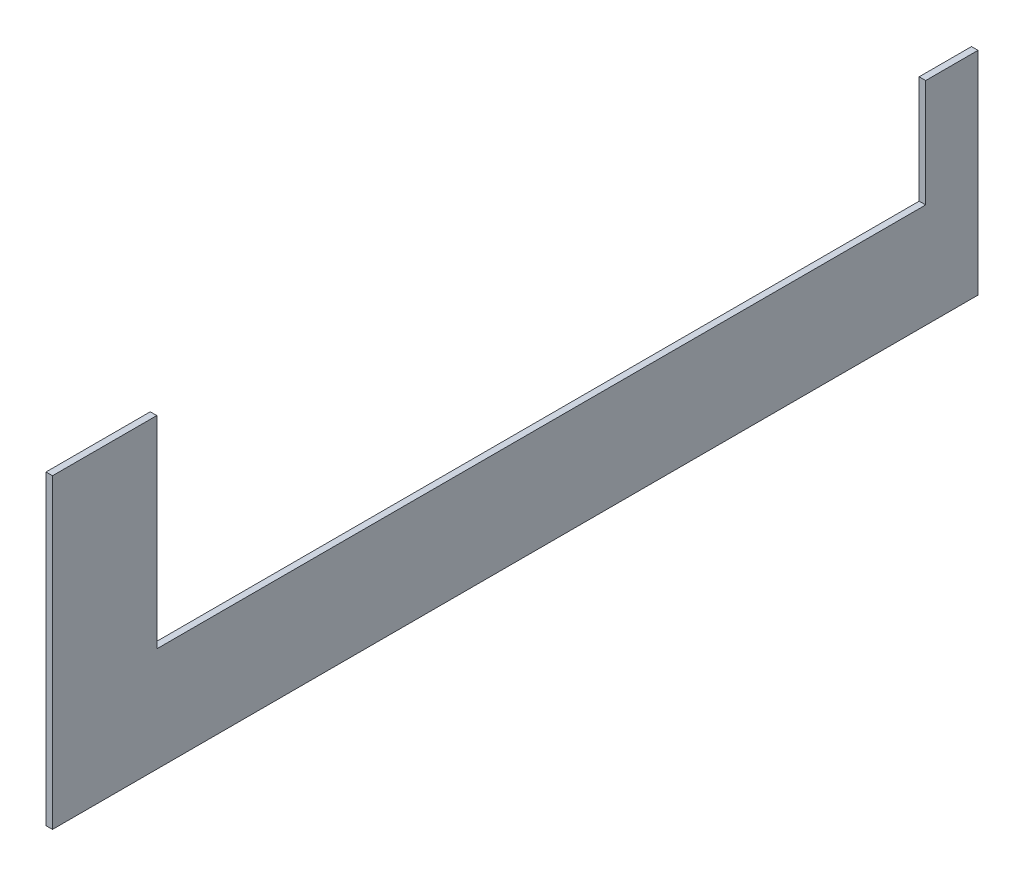
ISO-10303-21;
HEADER;
FILE_DESCRIPTION(('STEP AP214'),'2;1');
FILE_NAME('part.step','',(''),(''),'','','');
FILE_SCHEMA(('AUTOMOTIVE_DESIGN { 1 0 10303 214 1 1 1 1 }'));
ENDSEC;
DATA;
#1=APPLICATION_CONTEXT('core data for automotive mechanical design processes');
#2=APPLICATION_PROTOCOL_DEFINITION('international standard','automotive_design',2000,#1);
#3=PRODUCT_CONTEXT('',#1,'mechanical');
#4=PRODUCT('Part','Part','',(#3));
#5=PRODUCT_RELATED_PRODUCT_CATEGORY('part','',(#4));
#6=PRODUCT_DEFINITION_FORMATION('','',#4);
#7=PRODUCT_DEFINITION_CONTEXT('part definition',#1,'design');
#8=PRODUCT_DEFINITION('design','',#6,#7);
#9=PRODUCT_DEFINITION_SHAPE('','',#8);
#10=(LENGTH_UNIT() NAMED_UNIT(*) SI_UNIT(.MILLI.,.METRE.));
#11=(NAMED_UNIT(*) PLANE_ANGLE_UNIT() SI_UNIT($,.RADIAN.));
#12=(NAMED_UNIT(*) SI_UNIT($,.STERADIAN.) SOLID_ANGLE_UNIT());
#13=UNCERTAINTY_MEASURE_WITH_UNIT(LENGTH_MEASURE(1.E-05),#10,'distance_accuracy_value','');
#14=(GEOMETRIC_REPRESENTATION_CONTEXT(3) GLOBAL_UNCERTAINTY_ASSIGNED_CONTEXT((#13)) GLOBAL_UNIT_ASSIGNED_CONTEXT((#10,
#11,#12)) REPRESENTATION_CONTEXT('',''));
#15=CARTESIAN_POINT('',(0.,0.,0.));
#16=DIRECTION('',(0.,0.,1.));
#17=DIRECTION('',(1.,0.,0.));
#18=AXIS2_PLACEMENT_3D('',#15,#16,#17);
#19=CARTESIAN_POINT('',(3.175,0.,225.425));
#20=DIRECTION('',(0.,0.,-1.));
#21=DIRECTION('',(-1.,0.,0.));
#22=AXIS2_PLACEMENT_3D('',#19,#20,#21);
#23=PLANE('',#22);
#24=DIRECTION('',(0.,-1.,0.));
#25=VECTOR('',#24,1.);
#26=CARTESIAN_POINT('',(0.,0.,225.425));
#27=LINE('',#26,#25);
#28=CARTESIAN_POINT('',(0.,149.225,225.425));
#29=VERTEX_POINT('',#28);
#30=CARTESIAN_POINT('',(0.,0.,225.425));
#31=VERTEX_POINT('',#30);
#32=EDGE_CURVE('E129',#29,#31,#27,.T.);
#33=ORIENTED_EDGE('',*,*,#32,.T.);
#34=DIRECTION('',(-1.,0.,0.));
#35=VECTOR('',#34,1.);
#36=CARTESIAN_POINT('',(3.175,0.,225.425));
#37=LINE('',#36,#35);
#38=CARTESIAN_POINT('',(3.175,0.,225.425));
#39=VERTEX_POINT('',#38);
#40=EDGE_CURVE('E11',#39,#31,#37,.T.);
#41=ORIENTED_EDGE('',*,*,#40,.F.);
#42=DIRECTION('',(0.,-1.,0.));
#43=VECTOR('',#42,1.);
#44=CARTESIAN_POINT('',(3.175,0.,225.425));
#45=LINE('',#44,#43);
#46=CARTESIAN_POINT('',(3.175,149.225,225.425));
#47=VERTEX_POINT('',#46);
#48=EDGE_CURVE('E143',#47,#39,#45,.T.);
#49=ORIENTED_EDGE('',*,*,#48,.F.);
#50=DIRECTION('',(-1.,0.,0.));
#51=VECTOR('',#50,1.);
#52=CARTESIAN_POINT('',(3.175,149.225,225.425));
#53=LINE('',#52,#51);
#54=EDGE_CURVE('E125',#47,#29,#53,.T.);
#55=ORIENTED_EDGE('',*,*,#54,.T.);
#56=EDGE_LOOP('',(#33,#41,#49,#55));
#57=FACE_BOUND('',#56,.T.);
#58=ADVANCED_FACE('F33',(#57),#23,.F.);
#59=CARTESIAN_POINT('',(3.175,0.,225.425));
#60=DIRECTION('',(0.,1.,0.));
#61=DIRECTION('',(0.,0.,1.));
#62=AXIS2_PLACEMENT_3D('',#59,#60,#61);
#63=PLANE('',#62);
#64=DIRECTION('',(0.,0.,-1.));
#65=VECTOR('',#64,1.);
#66=CARTESIAN_POINT('',(0.,0.,225.425));
#67=LINE('',#66,#65);
#68=CARTESIAN_POINT('',(0.,0.,-225.425));
#69=VERTEX_POINT('',#68);
#70=EDGE_CURVE('E132',#31,#69,#67,.T.);
#71=ORIENTED_EDGE('',*,*,#70,.T.);
#72=DIRECTION('',(-1.,0.,0.));
#73=VECTOR('',#72,1.);
#74=CARTESIAN_POINT('',(3.175,0.,-225.425));
#75=LINE('',#74,#73);
#76=CARTESIAN_POINT('',(3.175,0.,-225.425));
#77=VERTEX_POINT('',#76);
#78=EDGE_CURVE('E41',#77,#69,#75,.T.);
#79=ORIENTED_EDGE('',*,*,#78,.F.);
#80=DIRECTION('',(0.,0.,-1.));
#81=VECTOR('',#80,1.);
#82=CARTESIAN_POINT('',(3.175,0.,225.425));
#83=LINE('',#82,#81);
#84=EDGE_CURVE('E92',#39,#77,#83,.T.);
#85=ORIENTED_EDGE('',*,*,#84,.F.);
#86=ORIENTED_EDGE('',*,*,#40,.T.);
#87=EDGE_LOOP('',(#71,#79,#85,#86));
#88=FACE_BOUND('',#87,.T.);
#89=ADVANCED_FACE('F178',(#88),#63,.F.);
#90=CARTESIAN_POINT('',(3.175,103.275983606557,-225.425));
#91=DIRECTION('',(0.,0.,1.));
#92=DIRECTION('',(1.,0.,0.));
#93=AXIS2_PLACEMENT_3D('',#90,#91,#92);
#94=PLANE('',#93);
#95=DIRECTION('',(0.,1.,0.));
#96=VECTOR('',#95,1.);
#97=CARTESIAN_POINT('',(0.,103.275983606557,-225.425));
#98=LINE('',#97,#96);
#99=CARTESIAN_POINT('',(0.,103.275983606557,-225.425));
#100=VERTEX_POINT('',#99);
#101=EDGE_CURVE('E134',#69,#100,#98,.T.);
#102=ORIENTED_EDGE('',*,*,#101,.T.);
#103=DIRECTION('',(-1.,0.,0.));
#104=VECTOR('',#103,1.);
#105=CARTESIAN_POINT('',(3.175,103.275983606557,-225.425));
#106=LINE('',#105,#104);
#107=CARTESIAN_POINT('',(3.175,103.275983606557,-225.425));
#108=VERTEX_POINT('',#107);
#109=EDGE_CURVE('E150',#108,#100,#106,.T.);
#110=ORIENTED_EDGE('',*,*,#109,.F.);
#111=DIRECTION('',(0.,1.,0.));
#112=VECTOR('',#111,1.);
#113=CARTESIAN_POINT('',(3.175,103.275983606557,-225.425));
#114=LINE('',#113,#112);
#115=EDGE_CURVE('E158',#77,#108,#114,.T.);
#116=ORIENTED_EDGE('',*,*,#115,.F.);
#117=ORIENTED_EDGE('',*,*,#78,.T.);
#118=EDGE_LOOP('',(#102,#110,#116,#117));
#119=FACE_BOUND('',#118,.T.);
#120=ADVANCED_FACE('F156',(#119),#94,.F.);
#121=CARTESIAN_POINT('',(3.175,103.275983606557,-199.926106557377));
#122=DIRECTION('',(0.,-1.,0.));
#123=DIRECTION('',(0.,0.,-1.));
#124=AXIS2_PLACEMENT_3D('',#121,#122,#123);
#125=PLANE('',#124);
#126=DIRECTION('',(0.,0.,1.));
#127=VECTOR('',#126,1.);
#128=CARTESIAN_POINT('',(0.,103.275983606557,-199.926106557377));
#129=LINE('',#128,#127);
#130=CARTESIAN_POINT('',(0.,103.275983606557,-199.926106557377));
#131=VERTEX_POINT('',#130);
#132=EDGE_CURVE('E136',#100,#131,#129,.T.);
#133=ORIENTED_EDGE('',*,*,#132,.T.);
#134=DIRECTION('',(-1.,0.,0.));
#135=VECTOR('',#134,1.);
#136=CARTESIAN_POINT('',(3.175,103.275983606557,-199.926106557377));
#137=LINE('',#136,#135);
#138=CARTESIAN_POINT('',(3.175,103.275983606557,-199.926106557377));
#139=VERTEX_POINT('',#138);
#140=EDGE_CURVE('E147',#139,#131,#137,.T.);
#141=ORIENTED_EDGE('',*,*,#140,.F.);
#142=DIRECTION('',(0.,0.,1.));
#143=VECTOR('',#142,1.);
#144=CARTESIAN_POINT('',(3.175,103.275983606557,-199.926106557377));
#145=LINE('',#144,#143);
#146=EDGE_CURVE('E170',#108,#139,#145,.T.);
#147=ORIENTED_EDGE('',*,*,#146,.F.);
#148=ORIENTED_EDGE('',*,*,#109,.T.);
#149=EDGE_LOOP('',(#133,#141,#147,#148));
#150=FACE_BOUND('',#149,.T.);
#151=ADVANCED_FACE('F166',(#150),#125,.F.);
#152=CARTESIAN_POINT('',(3.175,50.8,-199.926106557377));
#153=DIRECTION('',(0.,0.,-1.));
#154=DIRECTION('',(-1.,0.,0.));
#155=AXIS2_PLACEMENT_3D('',#152,#153,#154);
#156=PLANE('',#155);
#157=DIRECTION('',(0.,-1.,0.));
#158=VECTOR('',#157,1.);
#159=CARTESIAN_POINT('',(0.,50.8,-199.926106557377));
#160=LINE('',#159,#158);
#161=CARTESIAN_POINT('',(0.,50.8,-199.926106557377));
#162=VERTEX_POINT('',#161);
#163=EDGE_CURVE('E138',#131,#162,#160,.T.);
#164=ORIENTED_EDGE('',*,*,#163,.T.);
#165=DIRECTION('',(-1.,0.,0.));
#166=VECTOR('',#165,1.);
#167=CARTESIAN_POINT('',(3.175,50.8,-199.926106557377));
#168=LINE('',#167,#166);
#169=CARTESIAN_POINT('',(3.175,50.8,-199.926106557377));
#170=VERTEX_POINT('',#169);
#171=EDGE_CURVE('E120',#170,#162,#168,.T.);
#172=ORIENTED_EDGE('',*,*,#171,.F.);
#173=DIRECTION('',(0.,-1.,0.));
#174=VECTOR('',#173,1.);
#175=CARTESIAN_POINT('',(3.175,50.8,-199.926106557377));
#176=LINE('',#175,#174);
#177=EDGE_CURVE('E111',#139,#170,#176,.T.);
#178=ORIENTED_EDGE('',*,*,#177,.F.);
#179=ORIENTED_EDGE('',*,*,#140,.T.);
#180=EDGE_LOOP('',(#164,#172,#178,#179));
#181=FACE_BOUND('',#180,.T.);
#182=ADVANCED_FACE('F169',(#181),#156,.F.);
#183=CARTESIAN_POINT('',(3.175,50.8,174.625));
#184=DIRECTION('',(0.,-1.,0.));
#185=DIRECTION('',(0.,0.,-1.));
#186=AXIS2_PLACEMENT_3D('',#183,#184,#185);
#187=PLANE('',#186);
#188=DIRECTION('',(0.,0.,1.));
#189=VECTOR('',#188,1.);
#190=CARTESIAN_POINT('',(0.,50.8,174.625));
#191=LINE('',#190,#189);
#192=CARTESIAN_POINT('',(0.,50.8,174.625));
#193=VERTEX_POINT('',#192);
#194=EDGE_CURVE('E119',#162,#193,#191,.T.);
#195=ORIENTED_EDGE('',*,*,#194,.T.);
#196=DIRECTION('',(-1.,0.,0.));
#197=VECTOR('',#196,1.);
#198=CARTESIAN_POINT('',(3.175,50.8,174.625));
#199=LINE('',#198,#197);
#200=CARTESIAN_POINT('',(3.175,50.8,174.625));
#201=VERTEX_POINT('',#200);
#202=EDGE_CURVE('E116',#201,#193,#199,.T.);
#203=ORIENTED_EDGE('',*,*,#202,.F.);
#204=DIRECTION('',(0.,0.,1.));
#205=VECTOR('',#204,1.);
#206=CARTESIAN_POINT('',(3.175,50.8,174.625));
#207=LINE('',#206,#205);
#208=EDGE_CURVE('E105',#170,#201,#207,.T.);
#209=ORIENTED_EDGE('',*,*,#208,.F.);
#210=ORIENTED_EDGE('',*,*,#171,.T.);
#211=EDGE_LOOP('',(#195,#203,#209,#210));
#212=FACE_BOUND('',#211,.T.);
#213=ADVANCED_FACE('F117',(#212),#187,.F.);
#214=CARTESIAN_POINT('',(3.175,149.225,174.625));
#215=DIRECTION('',(0.,0.,1.));
#216=DIRECTION('',(1.,0.,0.));
#217=AXIS2_PLACEMENT_3D('',#214,#215,#216);
#218=PLANE('',#217);
#219=DIRECTION('',(0.,1.,0.));
#220=VECTOR('',#219,1.);
#221=CARTESIAN_POINT('',(0.,149.225,174.625));
#222=LINE('',#221,#220);
#223=CARTESIAN_POINT('',(0.,149.225,174.625));
#224=VERTEX_POINT('',#223);
#225=EDGE_CURVE('E78',#193,#224,#222,.T.);
#226=ORIENTED_EDGE('',*,*,#225,.T.);
#227=DIRECTION('',(-1.,0.,0.));
#228=VECTOR('',#227,1.);
#229=CARTESIAN_POINT('',(3.175,149.225,174.625));
#230=LINE('',#229,#228);
#231=CARTESIAN_POINT('',(3.175,149.225,174.625));
#232=VERTEX_POINT('',#231);
#233=EDGE_CURVE('E121',#232,#224,#230,.T.);
#234=ORIENTED_EDGE('',*,*,#233,.F.);
#235=DIRECTION('',(0.,1.,0.));
#236=VECTOR('',#235,1.);
#237=CARTESIAN_POINT('',(3.175,149.225,174.625));
#238=LINE('',#237,#236);
#239=EDGE_CURVE('E109',#201,#232,#238,.T.);
#240=ORIENTED_EDGE('',*,*,#239,.F.);
#241=ORIENTED_EDGE('',*,*,#202,.T.);
#242=EDGE_LOOP('',(#226,#234,#240,#241));
#243=FACE_BOUND('',#242,.T.);
#244=ADVANCED_FACE('F123',(#243),#218,.F.);
#245=CARTESIAN_POINT('',(3.175,149.225,225.425));
#246=DIRECTION('',(0.,-1.,0.));
#247=DIRECTION('',(0.,0.,-1.));
#248=AXIS2_PLACEMENT_3D('',#245,#246,#247);
#249=PLANE('',#248);
#250=DIRECTION('',(0.,0.,1.));
#251=VECTOR('',#250,1.);
#252=CARTESIAN_POINT('',(0.,149.225,225.425));
#253=LINE('',#252,#251);
#254=EDGE_CURVE('E84',#224,#29,#253,.T.);
#255=ORIENTED_EDGE('',*,*,#254,.T.);
#256=ORIENTED_EDGE('',*,*,#54,.F.);
#257=DIRECTION('',(0.,0.,1.));
#258=VECTOR('',#257,1.);
#259=CARTESIAN_POINT('',(3.175,149.225,225.425));
#260=LINE('',#259,#258);
#261=EDGE_CURVE('E49',#232,#47,#260,.T.);
#262=ORIENTED_EDGE('',*,*,#261,.F.);
#263=ORIENTED_EDGE('',*,*,#233,.T.);
#264=EDGE_LOOP('',(#255,#256,#262,#263));
#265=FACE_BOUND('',#264,.T.);
#266=ADVANCED_FACE('F194',(#265),#249,.F.);
#267=CARTESIAN_POINT('',(3.175,0.,0.));
#268=DIRECTION('',(-1.,0.,0.));
#269=DIRECTION('',(0.,0.,1.));
#270=AXIS2_PLACEMENT_3D('',#267,#268,#269);
#271=PLANE('',#270);
#272=ORIENTED_EDGE('',*,*,#48,.T.);
#273=ORIENTED_EDGE('',*,*,#84,.T.);
#274=ORIENTED_EDGE('',*,*,#115,.T.);
#275=ORIENTED_EDGE('',*,*,#146,.T.);
#276=ORIENTED_EDGE('',*,*,#177,.T.);
#277=ORIENTED_EDGE('',*,*,#208,.T.);
#278=ORIENTED_EDGE('',*,*,#239,.T.);
#279=ORIENTED_EDGE('',*,*,#261,.T.);
#280=EDGE_LOOP('',(#272,#273,#274,#275,#276,#277,#278,#279));
#281=FACE_BOUND('',#280,.T.);
#282=ADVANCED_FACE('F107',(#281),#271,.F.);
#283=CARTESIAN_POINT('',(0.,0.,0.));
#284=DIRECTION('',(-1.,0.,0.));
#285=DIRECTION('',(0.,0.,1.));
#286=AXIS2_PLACEMENT_3D('',#283,#284,#285);
#287=PLANE('',#286);
#288=ORIENTED_EDGE('',*,*,#32,.F.);
#289=ORIENTED_EDGE('',*,*,#254,.F.);
#290=ORIENTED_EDGE('',*,*,#225,.F.);
#291=ORIENTED_EDGE('',*,*,#194,.F.);
#292=ORIENTED_EDGE('',*,*,#163,.F.);
#293=ORIENTED_EDGE('',*,*,#132,.F.);
#294=ORIENTED_EDGE('',*,*,#101,.F.);
#295=ORIENTED_EDGE('',*,*,#70,.F.);
#296=EDGE_LOOP('',(#288,#289,#290,#291,#292,#293,#294,#295));
#297=FACE_BOUND('',#296,.T.);
#298=ADVANCED_FACE('F162',(#297),#287,.T.);
#299=CLOSED_SHELL('',(#58,#89,#120,#151,#182,#213,#244,#266,#282,#298));
#300=MANIFOLD_SOLID_BREP('B2',#299);
#301=ADVANCED_BREP_SHAPE_REPRESENTATION('',(#18,#300),#14);
#302=SHAPE_DEFINITION_REPRESENTATION(#9,#301);
ENDSEC;
END-ISO-10303-21;
